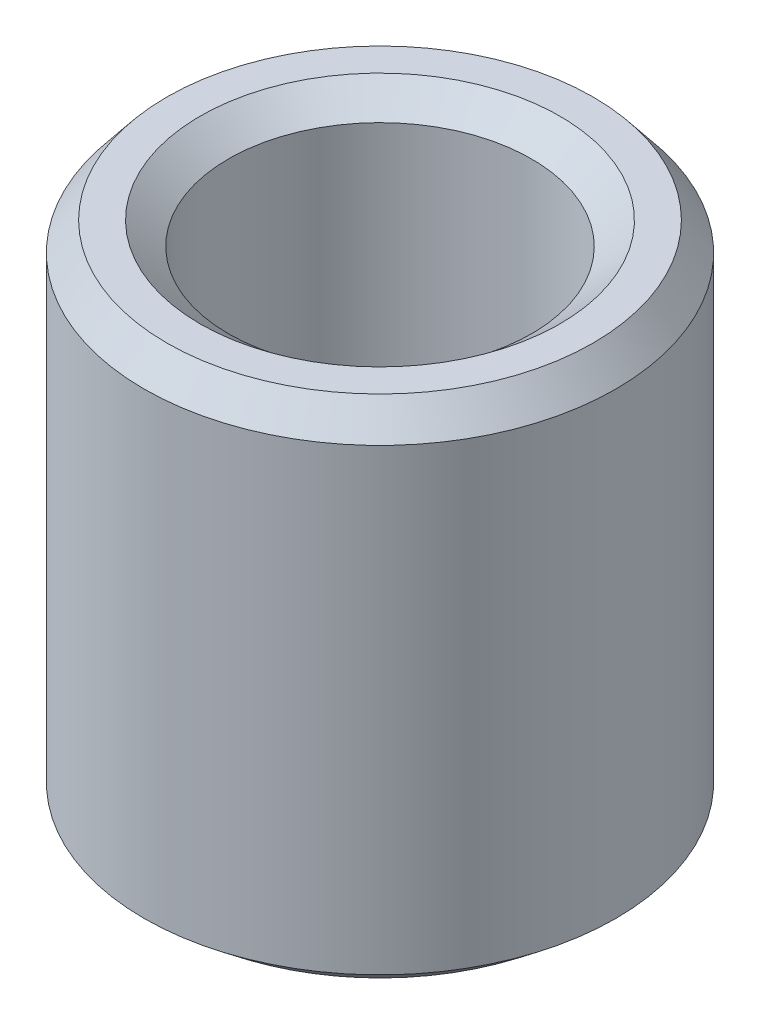
ISO-10303-21;
HEADER;
FILE_DESCRIPTION(('STEP AP214'),'2;1');
FILE_NAME('part.step','',(''),(''),'','','');
FILE_SCHEMA(('AUTOMOTIVE_DESIGN { 1 0 10303 214 1 1 1 1 }'));
ENDSEC;
DATA;
#1=APPLICATION_CONTEXT('core data for automotive mechanical design processes');
#2=APPLICATION_PROTOCOL_DEFINITION('international standard','automotive_design',2000,#1);
#3=PRODUCT_CONTEXT('',#1,'mechanical');
#4=PRODUCT('Part','Part','',(#3));
#5=PRODUCT_RELATED_PRODUCT_CATEGORY('part','',(#4));
#6=PRODUCT_DEFINITION_FORMATION('','',#4);
#7=PRODUCT_DEFINITION_CONTEXT('part definition',#1,'design');
#8=PRODUCT_DEFINITION('design','',#6,#7);
#9=PRODUCT_DEFINITION_SHAPE('','',#8);
#10=(LENGTH_UNIT() NAMED_UNIT(*) SI_UNIT(.MILLI.,.METRE.));
#11=(NAMED_UNIT(*) PLANE_ANGLE_UNIT() SI_UNIT($,.RADIAN.));
#12=(NAMED_UNIT(*) SI_UNIT($,.STERADIAN.) SOLID_ANGLE_UNIT());
#13=UNCERTAINTY_MEASURE_WITH_UNIT(LENGTH_MEASURE(1.E-05),#10,'distance_accuracy_value','');
#14=(GEOMETRIC_REPRESENTATION_CONTEXT(3) GLOBAL_UNCERTAINTY_ASSIGNED_CONTEXT((#13)) GLOBAL_UNIT_ASSIGNED_CONTEXT((#10,
#11,#12)) REPRESENTATION_CONTEXT('',''));
#15=CARTESIAN_POINT('',(0.,0.,0.));
#16=DIRECTION('',(0.,0.,1.));
#17=DIRECTION('',(1.,0.,0.));
#18=AXIS2_PLACEMENT_3D('',#15,#16,#17);
#19=CARTESIAN_POINT('',(0.,43.2094113314877,0.));
#20=DIRECTION('',(0.,-1.,0.));
#21=DIRECTION('',(0.,0.,-1.));
#22=AXIS2_PLACEMENT_3D('',#19,#20,#21);
#23=CYLINDRICAL_SURFACE('',#22,20.);
#24=CARTESIAN_POINT('',(0.,1.93251760356482,0.));
#25=DIRECTION('',(0.,1.,0.));
#26=DIRECTION('',(0.,0.,1.));
#27=AXIS2_PLACEMENT_3D('',#24,#25,#26);
#28=CIRCLE('',#27,20.);
#29=CARTESIAN_POINT('',(0.,1.93251760356482,20.));
#30=VERTEX_POINT('',#29);
#31=EDGE_CURVE('E10',#30,#30,#28,.T.);
#32=ORIENTED_EDGE('',*,*,#31,.T.);
#33=EDGE_LOOP('',(#32));
#34=FACE_BOUND('',#33,.T.);
#35=CARTESIAN_POINT('',(0.,40.8014093032028,0.));
#36=DIRECTION('',(0.,1.,0.));
#37=DIRECTION('',(0.,0.,1.));
#38=AXIS2_PLACEMENT_3D('',#35,#36,#37);
#39=CIRCLE('',#38,20.);
#40=CARTESIAN_POINT('',(0.,40.8014093032028,20.));
#41=VERTEX_POINT('',#40);
#42=EDGE_CURVE('E50',#41,#41,#39,.F.);
#43=ORIENTED_EDGE('',*,*,#42,.T.);
#44=EDGE_LOOP('',(#43));
#45=FACE_BOUND('',#44,.T.);
#46=ADVANCED_FACE('F39',(#34,#45),#23,.T.);
#47=CARTESIAN_POINT('',(0.,43.2094113314877,0.));
#48=DIRECTION('',(0.,1.,0.));
#49=DIRECTION('',(0.,0.,1.));
#50=AXIS2_PLACEMENT_3D('',#47,#48,#49);
#51=PLANE('',#50);
#52=CARTESIAN_POINT('',(0.,43.2094113314877,0.));
#53=DIRECTION('',(0.,1.,0.));
#54=DIRECTION('',(0.,0.,1.));
#55=AXIS2_PLACEMENT_3D('',#52,#53,#54);
#56=CIRCLE('',#55,15.2537344131897);
#57=CARTESIAN_POINT('',(0.,43.2094113314877,15.2537344131897));
#58=VERTEX_POINT('',#57);
#59=EDGE_CURVE('E58',#58,#58,#56,.F.);
#60=ORIENTED_EDGE('',*,*,#59,.T.);
#61=EDGE_LOOP('',(#60));
#62=FACE_BOUND('',#61,.T.);
#63=CARTESIAN_POINT('',(0.,43.2094113314877,0.));
#64=DIRECTION('',(0.,1.,0.));
#65=DIRECTION('',(0.,0.,1.));
#66=AXIS2_PLACEMENT_3D('',#63,#64,#65);
#67=CIRCLE('',#66,18.0674823964352);
#68=CARTESIAN_POINT('',(0.,43.2094113314877,18.0674823964352));
#69=VERTEX_POINT('',#68);
#70=EDGE_CURVE('E61',#69,#69,#67,.T.);
#71=ORIENTED_EDGE('',*,*,#70,.T.);
#72=EDGE_LOOP('',(#71));
#73=FACE_BOUND('',#72,.T.);
#74=ADVANCED_FACE('F88',(#62,#73),#51,.T.);
#75=CARTESIAN_POINT('',(0.,0.,0.));
#76=DIRECTION('',(0.,1.,0.));
#77=DIRECTION('',(0.,0.,1.));
#78=AXIS2_PLACEMENT_3D('',#75,#76,#77);
#79=PLANE('',#78);
#80=CARTESIAN_POINT('',(0.,0.,0.));
#81=DIRECTION('',(0.,1.,0.));
#82=DIRECTION('',(0.,0.,1.));
#83=AXIS2_PLACEMENT_3D('',#80,#81,#82);
#84=CIRCLE('',#83,14.7782499884697);
#85=CARTESIAN_POINT('',(0.,0.,14.7782499884697));
#86=VERTEX_POINT('',#85);
#87=EDGE_CURVE('E51',#86,#86,#84,.T.);
#88=ORIENTED_EDGE('',*,*,#87,.T.);
#89=EDGE_LOOP('',(#88));
#90=FACE_BOUND('',#89,.T.);
#91=CARTESIAN_POINT('',(0.,0.,0.));
#92=DIRECTION('',(0.,1.,0.));
#93=DIRECTION('',(0.,0.,1.));
#94=AXIS2_PLACEMENT_3D('',#91,#92,#93);
#95=CIRCLE('',#94,17.5919979717152);
#96=CARTESIAN_POINT('',(0.,0.,17.5919979717152));
#97=VERTEX_POINT('',#96);
#98=EDGE_CURVE('E54',#97,#97,#95,.F.);
#99=ORIENTED_EDGE('',*,*,#98,.T.);
#100=EDGE_LOOP('',(#99));
#101=FACE_BOUND('',#100,.T.);
#102=ADVANCED_FACE('F83',(#90,#101),#79,.F.);
#103=CARTESIAN_POINT('',(0.,43.2094113314877,0.));
#104=DIRECTION('',(0.,-1.,0.));
#105=DIRECTION('',(0.,0.,-1.));
#106=AXIS2_PLACEMENT_3D('',#103,#104,#105);
#107=CYLINDRICAL_SURFACE('',#106,12.8457323849049);
#108=CARTESIAN_POINT('',(0.,41.2768937279228,0.));
#109=DIRECTION('',(0.,1.,0.));
#110=DIRECTION('',(0.,0.,1.));
#111=AXIS2_PLACEMENT_3D('',#108,#109,#110);
#112=CIRCLE('',#111,12.8457323849049);
#113=CARTESIAN_POINT('',(0.,41.2768937279228,12.8457323849049));
#114=VERTEX_POINT('',#113);
#115=EDGE_CURVE('E67',#114,#114,#112,.T.);
#116=ORIENTED_EDGE('',*,*,#115,.T.);
#117=EDGE_LOOP('',(#116));
#118=FACE_BOUND('',#117,.T.);
#119=CARTESIAN_POINT('',(0.,2.40800202828481,0.));
#120=DIRECTION('',(0.,1.,0.));
#121=DIRECTION('',(0.,0.,1.));
#122=AXIS2_PLACEMENT_3D('',#119,#120,#121);
#123=CIRCLE('',#122,12.8457323849049);
#124=CARTESIAN_POINT('',(0.,2.40800202828481,12.8457323849049));
#125=VERTEX_POINT('',#124);
#126=EDGE_CURVE('E69',#125,#125,#123,.F.);
#127=ORIENTED_EDGE('',*,*,#126,.T.);
#128=EDGE_LOOP('',(#127));
#129=FACE_BOUND('',#128,.T.);
#130=ADVANCED_FACE('F71',(#118,#129),#107,.F.);
#131=CARTESIAN_POINT('',(0.,41.2768937279228,0.));
#132=DIRECTION('',(0.,1.,0.));
#133=DIRECTION('',(0.,0.,1.));
#134=AXIS2_PLACEMENT_3D('',#131,#132,#133);
#135=CONICAL_SURFACE('',#134,12.8457323849049,0.89450860886595);
#136=ORIENTED_EDGE('',*,*,#59,.F.);
#137=EDGE_LOOP('',(#136));
#138=FACE_BOUND('',#137,.T.);
#139=ORIENTED_EDGE('',*,*,#115,.F.);
#140=EDGE_LOOP('',(#139));
#141=FACE_BOUND('',#140,.T.);
#142=ADVANCED_FACE('F77',(#138,#141),#135,.F.);
#143=CARTESIAN_POINT('',(0.,0.,0.));
#144=DIRECTION('',(0.,-1.,0.));
#145=DIRECTION('',(0.,0.,-1.));
#146=AXIS2_PLACEMENT_3D('',#143,#144,#145);
#147=CONICAL_SURFACE('',#146,14.7782499884697,0.676287717928946);
#148=ORIENTED_EDGE('',*,*,#126,.F.);
#149=EDGE_LOOP('',(#148));
#150=FACE_BOUND('',#149,.T.);
#151=ORIENTED_EDGE('',*,*,#87,.F.);
#152=EDGE_LOOP('',(#151));
#153=FACE_BOUND('',#152,.T.);
#154=ADVANCED_FACE('F73',(#150,#153),#147,.F.);
#155=CARTESIAN_POINT('',(0.,1.93251760356482,0.));
#156=DIRECTION('',(0.,1.,0.));
#157=DIRECTION('',(0.,0.,1.));
#158=AXIS2_PLACEMENT_3D('',#155,#156,#157);
#159=CONICAL_SURFACE('',#158,20.,0.894508608865953);
#160=ORIENTED_EDGE('',*,*,#98,.F.);
#161=EDGE_LOOP('',(#160));
#162=FACE_BOUND('',#161,.T.);
#163=ORIENTED_EDGE('',*,*,#31,.F.);
#164=EDGE_LOOP('',(#163));
#165=FACE_BOUND('',#164,.T.);
#166=ADVANCED_FACE('F76',(#162,#165),#159,.T.);
#167=CARTESIAN_POINT('',(0.,43.2094113314877,0.));
#168=DIRECTION('',(0.,-1.,0.));
#169=DIRECTION('',(0.,0.,-1.));
#170=AXIS2_PLACEMENT_3D('',#167,#168,#169);
#171=CONICAL_SURFACE('',#170,18.0674823964352,0.676287717928944);
#172=ORIENTED_EDGE('',*,*,#42,.F.);
#173=EDGE_LOOP('',(#172));
#174=FACE_BOUND('',#173,.T.);
#175=ORIENTED_EDGE('',*,*,#70,.F.);
#176=EDGE_LOOP('',(#175));
#177=FACE_BOUND('',#176,.T.);
#178=ADVANCED_FACE('F45',(#174,#177),#171,.T.);
#179=CLOSED_SHELL('',(#46,#74,#102,#130,#142,#154,#166,#178));
#180=MANIFOLD_SOLID_BREP('B2',#179);
#181=ADVANCED_BREP_SHAPE_REPRESENTATION('',(#18,#180),#14);
#182=SHAPE_DEFINITION_REPRESENTATION(#9,#181);
ENDSEC;
END-ISO-10303-21;
